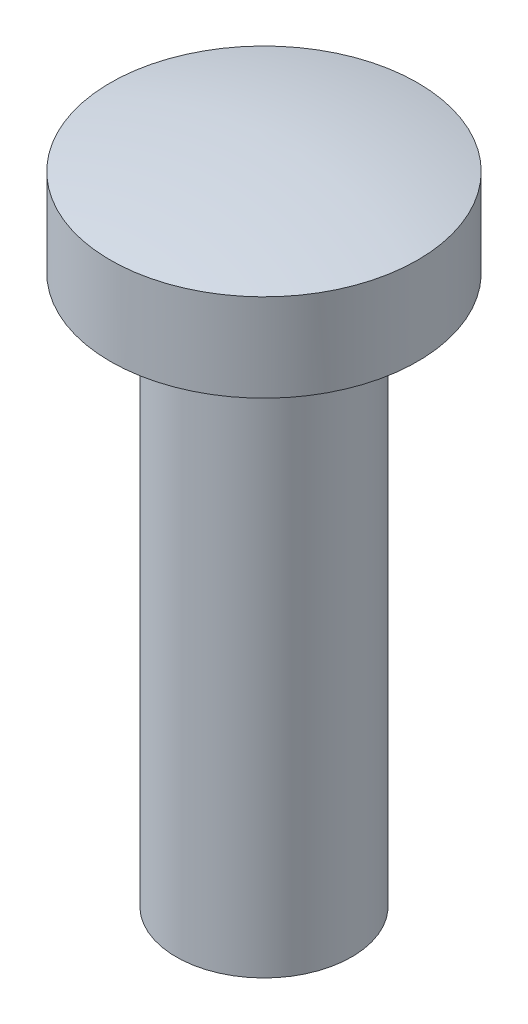
ISO-10303-21;
HEADER;
FILE_DESCRIPTION(('STEP AP214'),'2;1');
FILE_NAME('part.step','',(''),(''),'','','');
FILE_SCHEMA(('AUTOMOTIVE_DESIGN { 1 0 10303 214 1 1 1 1 }'));
ENDSEC;
DATA;
#1=APPLICATION_CONTEXT('core data for automotive mechanical design processes');
#2=APPLICATION_PROTOCOL_DEFINITION('international standard','automotive_design',2000,#1);
#3=PRODUCT_CONTEXT('',#1,'mechanical');
#4=PRODUCT('Part','Part','',(#3));
#5=PRODUCT_RELATED_PRODUCT_CATEGORY('part','',(#4));
#6=PRODUCT_DEFINITION_FORMATION('','',#4);
#7=PRODUCT_DEFINITION_CONTEXT('part definition',#1,'design');
#8=PRODUCT_DEFINITION('design','',#6,#7);
#9=PRODUCT_DEFINITION_SHAPE('','',#8);
#10=(LENGTH_UNIT() NAMED_UNIT(*) SI_UNIT(.MILLI.,.METRE.));
#11=(NAMED_UNIT(*) PLANE_ANGLE_UNIT() SI_UNIT($,.RADIAN.));
#12=(NAMED_UNIT(*) SI_UNIT($,.STERADIAN.) SOLID_ANGLE_UNIT());
#13=UNCERTAINTY_MEASURE_WITH_UNIT(LENGTH_MEASURE(1.E-05),#10,'distance_accuracy_value','');
#14=(GEOMETRIC_REPRESENTATION_CONTEXT(3) GLOBAL_UNCERTAINTY_ASSIGNED_CONTEXT((#13)) GLOBAL_UNIT_ASSIGNED_CONTEXT((#10,
#11,#12)) REPRESENTATION_CONTEXT('',''));
#15=CARTESIAN_POINT('',(0.,0.,0.));
#16=DIRECTION('',(0.,0.,1.));
#17=DIRECTION('',(1.,0.,0.));
#18=AXIS2_PLACEMENT_3D('',#15,#16,#17);
#19=CARTESIAN_POINT('',(4.00000000000001,0.,0.));
#20=DIRECTION('',(0.,-1.,0.));
#21=DIRECTION('',(0.,0.,-1.));
#22=AXIS2_PLACEMENT_3D('',#19,#20,#21);
#23=PLANE('',#22);
#24=CARTESIAN_POINT('',(0.,0.,0.));
#25=DIRECTION('',(0.,-1.,0.));
#26=DIRECTION('',(0.,0.,-1.));
#27=AXIS2_PLACEMENT_3D('',#24,#25,#26);
#28=CIRCLE('',#27,4.00000000000001);
#29=CARTESIAN_POINT('',(0.,0.,-4.00000000000001));
#30=VERTEX_POINT('',#29);
#31=EDGE_CURVE('E10',#30,#30,#28,.T.);
#32=ORIENTED_EDGE('',*,*,#31,.T.);
#33=EDGE_LOOP('',(#32));
#34=FACE_BOUND('',#33,.T.);
#35=ADVANCED_FACE('F31',(#34),#23,.T.);
#36=CARTESIAN_POINT('',(0.,0.,0.));
#37=DIRECTION('',(0.,-1.,0.));
#38=DIRECTION('',(0.,0.,-1.));
#39=AXIS2_PLACEMENT_3D('',#36,#37,#38);
#40=CYLINDRICAL_SURFACE('',#39,4.);
#41=CARTESIAN_POINT('',(0.,25.,0.));
#42=DIRECTION('',(0.,-1.,0.));
#43=DIRECTION('',(0.,0.,-1.));
#44=AXIS2_PLACEMENT_3D('',#41,#42,#43);
#45=CIRCLE('',#44,4.);
#46=CARTESIAN_POINT('',(0.,25.,-4.));
#47=VERTEX_POINT('',#46);
#48=EDGE_CURVE('E37',#47,#47,#45,.T.);
#49=ORIENTED_EDGE('',*,*,#48,.T.);
#50=EDGE_LOOP('',(#49));
#51=FACE_BOUND('',#50,.T.);
#52=ORIENTED_EDGE('',*,*,#31,.F.);
#53=EDGE_LOOP('',(#52));
#54=FACE_BOUND('',#53,.T.);
#55=ADVANCED_FACE('F63',(#51,#54),#40,.T.);
#56=CARTESIAN_POINT('',(4.,25.,0.));
#57=DIRECTION('',(0.,-1.,0.));
#58=DIRECTION('',(0.,0.,-1.));
#59=AXIS2_PLACEMENT_3D('',#56,#57,#58);
#60=PLANE('',#59);
#61=CARTESIAN_POINT('',(0.,25.,0.));
#62=DIRECTION('',(0.,-1.,0.));
#63=DIRECTION('',(0.,0.,-1.));
#64=AXIS2_PLACEMENT_3D('',#61,#62,#63);
#65=CIRCLE('',#64,7.);
#66=CARTESIAN_POINT('',(0.,25.,-7.));
#67=VERTEX_POINT('',#66);
#68=EDGE_CURVE('E41',#67,#67,#65,.T.);
#69=ORIENTED_EDGE('',*,*,#68,.T.);
#70=EDGE_LOOP('',(#69));
#71=FACE_BOUND('',#70,.T.);
#72=ORIENTED_EDGE('',*,*,#48,.F.);
#73=EDGE_LOOP('',(#72));
#74=FACE_BOUND('',#73,.T.);
#75=ADVANCED_FACE('F60',(#71,#74),#60,.T.);
#76=CARTESIAN_POINT('',(0.,0.,0.));
#77=DIRECTION('',(0.,-1.,0.));
#78=DIRECTION('',(0.,0.,-1.));
#79=AXIS2_PLACEMENT_3D('',#76,#77,#78);
#80=CYLINDRICAL_SURFACE('',#79,7.);
#81=CARTESIAN_POINT('',(0.,29.,0.));
#82=DIRECTION('',(0.,-1.,0.));
#83=DIRECTION('',(0.,0.,-1.));
#84=AXIS2_PLACEMENT_3D('',#81,#82,#83);
#85=CIRCLE('',#84,7.);
#86=CARTESIAN_POINT('',(0.,29.,-7.));
#87=VERTEX_POINT('',#86);
#88=EDGE_CURVE('E45',#87,#87,#85,.T.);
#89=ORIENTED_EDGE('',*,*,#88,.T.);
#90=EDGE_LOOP('',(#89));
#91=FACE_BOUND('',#90,.T.);
#92=ORIENTED_EDGE('',*,*,#68,.F.);
#93=EDGE_LOOP('',(#92));
#94=FACE_BOUND('',#93,.T.);
#95=ADVANCED_FACE('F51',(#91,#94),#80,.T.);
#96=CARTESIAN_POINT('',(0.,0.,0.));
#97=DIRECTION('',(0.,-1.,0.));
#98=DIRECTION('',(1.,0.,0.));
#99=AXIS2_PLACEMENT_3D('',#96,#97,#98);
#100=SPHERICAL_SURFACE('',#99,29.8328677803526);
#101=ORIENTED_EDGE('',*,*,#88,.F.);
#102=EDGE_LOOP('',(#101));
#103=FACE_BOUND('',#102,.T.);
#104=ADVANCED_FACE('F54',(#103),#100,.T.);
#105=CLOSED_SHELL('',(#35,#55,#75,#95,#104));
#106=MANIFOLD_SOLID_BREP('B2',#105);
#107=ADVANCED_BREP_SHAPE_REPRESENTATION('',(#18,#106),#14);
#108=SHAPE_DEFINITION_REPRESENTATION(#9,#107);
ENDSEC;
END-ISO-10303-21;
